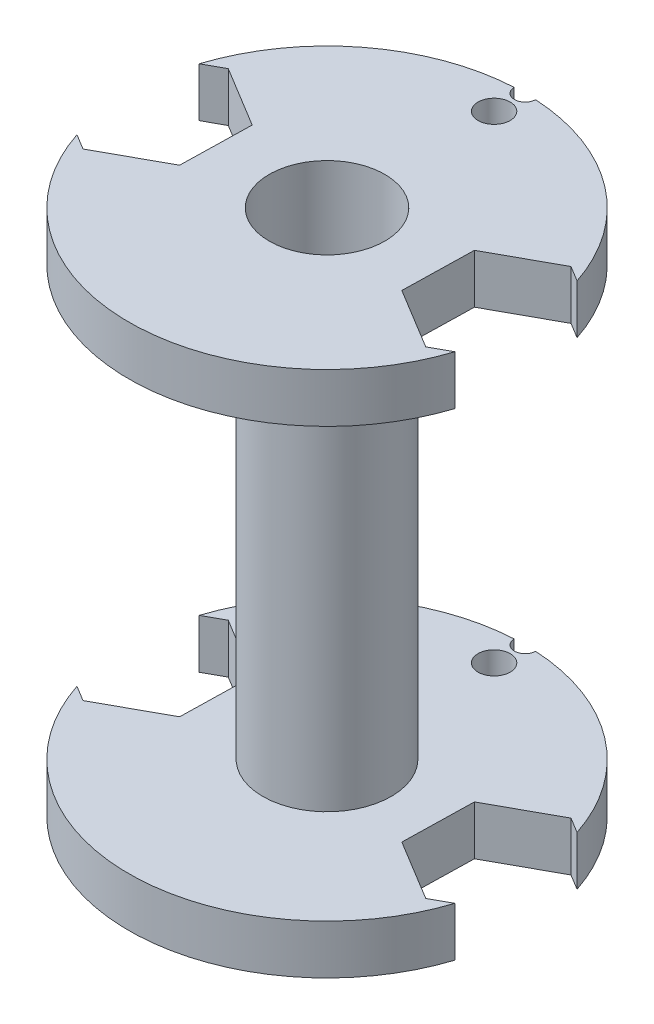
ISO-10303-21;
HEADER;
FILE_DESCRIPTION(('STEP AP214'),'2;1');
FILE_NAME('part.step','',(''),(''),'','','');
FILE_SCHEMA(('AUTOMOTIVE_DESIGN { 1 0 10303 214 1 1 1 1 }'));
ENDSEC;
DATA;
#1=APPLICATION_CONTEXT('core data for automotive mechanical design processes');
#2=APPLICATION_PROTOCOL_DEFINITION('international standard','automotive_design',2000,#1);
#3=PRODUCT_CONTEXT('',#1,'mechanical');
#4=PRODUCT('Part','Part','',(#3));
#5=PRODUCT_RELATED_PRODUCT_CATEGORY('part','',(#4));
#6=PRODUCT_DEFINITION_FORMATION('','',#4);
#7=PRODUCT_DEFINITION_CONTEXT('part definition',#1,'design');
#8=PRODUCT_DEFINITION('design','',#6,#7);
#9=PRODUCT_DEFINITION_SHAPE('','',#8);
#10=(LENGTH_UNIT() NAMED_UNIT(*) SI_UNIT(.MILLI.,.METRE.));
#11=(NAMED_UNIT(*) PLANE_ANGLE_UNIT() SI_UNIT($,.RADIAN.));
#12=(NAMED_UNIT(*) SI_UNIT($,.STERADIAN.) SOLID_ANGLE_UNIT());
#13=UNCERTAINTY_MEASURE_WITH_UNIT(LENGTH_MEASURE(1.E-05),#10,'distance_accuracy_value','');
#14=(GEOMETRIC_REPRESENTATION_CONTEXT(3) GLOBAL_UNCERTAINTY_ASSIGNED_CONTEXT((#13)) GLOBAL_UNIT_ASSIGNED_CONTEXT((#10,
#11,#12)) REPRESENTATION_CONTEXT('',''));
#15=CARTESIAN_POINT('',(0.,0.,0.));
#16=DIRECTION('',(0.,0.,1.));
#17=DIRECTION('',(1.,0.,0.));
#18=AXIS2_PLACEMENT_3D('',#15,#16,#17);
#19=CARTESIAN_POINT('',(0.,2.3,0.));
#20=DIRECTION('',(0.,1.,0.));
#21=DIRECTION('',(0.,0.,1.));
#22=AXIS2_PLACEMENT_3D('',#19,#20,#21);
#23=PLANE('',#22);
#24=CARTESIAN_POINT('',(0.,2.3,-9.25));
#25=DIRECTION('',(0.,1.,0.));
#26=DIRECTION('',(0.,0.,1.));
#27=AXIS2_PLACEMENT_3D('',#24,#25,#26);
#28=CIRCLE('',#27,0.5);
#29=CARTESIAN_POINT('',(-0.499817351592079,2.3,-9.23648648648649));
#30=VERTEX_POINT('',#29);
#31=CARTESIAN_POINT('',(0.499817351592079,2.3,-9.23648648648649));
#32=VERTEX_POINT('',#31);
#33=EDGE_CURVE('E357',#30,#32,#28,.T.);
#34=ORIENTED_EDGE('',*,*,#33,.F.);
#35=CARTESIAN_POINT('',(0.,2.3,0.));
#36=DIRECTION('',(0.,1.,0.));
#37=DIRECTION('',(0.,0.,1.));
#38=AXIS2_PLACEMENT_3D('',#35,#36,#37);
#39=CIRCLE('',#38,9.25);
#40=CARTESIAN_POINT('',(-8.80369400600624,2.3,-2.83856862672189));
#41=VERTEX_POINT('',#40);
#42=EDGE_CURVE('E434',#30,#41,#39,.T.);
#43=ORIENTED_EDGE('',*,*,#42,.T.);
#44=DIRECTION('',(-0.87656895196481,0.,0.48127629533493));
#45=VECTOR('',#44,1.);
#46=CARTESIAN_POINT('',(-3.23668432869814,2.3,-5.89511059935624));
#47=LINE('',#46,#45);
#48=CARTESIAN_POINT('',(-7.92866830299493,2.3,-3.31899760806348));
#49=VERTEX_POINT('',#48);
#50=EDGE_CURVE('E408',#49,#41,#47,.T.);
#51=ORIENTED_EDGE('',*,*,#50,.F.);
#52=DIRECTION('',(-0.855081973981716,0.,-0.518492832902762));
#53=VECTOR('',#52,1.);
#54=CARTESIAN_POINT('',(-0.660011647577101,2.3,1.08847032523397));
#55=LINE('',#54,#53);
#56=CARTESIAN_POINT('',(-5.08999790781407,2.3,-1.59772374233));
#57=VERTEX_POINT('',#56);
#58=EDGE_CURVE('E417',#57,#49,#55,.T.);
#59=ORIENTED_EDGE('',*,*,#58,.F.);
#60=DIRECTION('',(0.0214869779830933,0.,-0.999769128237692));
#61=VECTOR('',#60,1.);
#62=CARTESIAN_POINT('',(-5.1219702345338,2.3,-0.110081076271562));
#63=LINE('',#62,#61);
#64=CARTESIAN_POINT('',(-5.16132960481908,2.3,1.72127386573417));
#65=VERTEX_POINT('',#64);
#66=EDGE_CURVE('E419',#65,#57,#63,.T.);
#67=ORIENTED_EDGE('',*,*,#66,.F.);
#68=DIRECTION('',(0.87656895196481,0.,-0.48127629533493));
#69=VECTOR('',#68,1.);
#70=CARTESIAN_POINT('',(-0.469345630522289,2.3,-0.854839125558582));
#71=LINE('',#70,#69);
#72=CARTESIAN_POINT('',(-8.07133169700495,2.3,3.31899760806487));
#73=VERTEX_POINT('',#72);
#74=EDGE_CURVE('E415',#73,#65,#71,.T.);
#75=ORIENTED_EDGE('',*,*,#74,.F.);
#76=DIRECTION('',(0.855081973981716,0.,0.518492832902762));
#77=VECTOR('',#76,1.);
#78=CARTESIAN_POINT('',(-3.64134543676798,2.3,6.00519167562884));
#79=LINE('',#78,#77);
#80=CARTESIAN_POINT('',(-8.78896564841738,2.3,2.88384861442816));
#81=VERTEX_POINT('',#80);
#82=EDGE_CURVE('E381',#81,#73,#79,.T.);
#83=ORIENTED_EDGE('',*,*,#82,.F.);
#84=CARTESIAN_POINT('',(8.80369400600608,2.3,2.83856862672237));
#85=VERTEX_POINT('',#84);
#86=EDGE_CURVE('E431',#81,#85,#39,.T.);
#87=ORIENTED_EDGE('',*,*,#86,.T.);
#88=DIRECTION('',(0.876568951964868,0.,-0.481276295334824));
#89=VECTOR('',#88,1.);
#90=CARTESIAN_POINT('',(3.23668432869722,2.3,5.89511059935626));
#91=LINE('',#90,#89);
#92=CARTESIAN_POINT('',(7.92866830299465,2.3,3.3189976080639));
#93=VERTEX_POINT('',#92);
#94=EDGE_CURVE('E413',#93,#85,#91,.T.);
#95=ORIENTED_EDGE('',*,*,#94,.F.);
#96=DIRECTION('',(0.855081973981654,0.,0.518492832902865));
#97=VECTOR('',#96,1.);
#98=CARTESIAN_POINT('',(0.660011647577505,2.3,-1.08847032523434));
#99=LINE('',#98,#97);
#100=CARTESIAN_POINT('',(5.089997907814,2.3,1.59772374233007));
#101=VERTEX_POINT('',#100);
#102=EDGE_CURVE('E423',#101,#93,#99,.T.);
#103=ORIENTED_EDGE('',*,*,#102,.F.);
#104=DIRECTION('',(-0.0214869779832137,0.,0.999769128237689));
#105=VECTOR('',#104,1.);
#106=CARTESIAN_POINT('',(5.12197023453389,2.3,0.110081076272182));
#107=LINE('',#106,#105);
#108=CARTESIAN_POINT('',(5.16132960481941,2.3,-1.72127386573409));
#109=VERTEX_POINT('',#108);
#110=EDGE_CURVE('E425',#109,#101,#107,.T.);
#111=ORIENTED_EDGE('',*,*,#110,.F.);
#112=DIRECTION('',(-0.876568951964868,0.,0.481276295334825));
#113=VECTOR('',#112,1.);
#114=CARTESIAN_POINT('',(0.469345630521984,2.3,0.854839125558272));
#115=LINE('',#114,#113);
#116=CARTESIAN_POINT('',(8.07133169700547,2.3,-3.31899760806444));
#117=VERTEX_POINT('',#116);
#118=EDGE_CURVE('E421',#117,#109,#115,.T.);
#119=ORIENTED_EDGE('',*,*,#118,.F.);
#120=DIRECTION('',(-0.855081973981654,0.,-0.518492832902865));
#121=VECTOR('',#120,1.);
#122=CARTESIAN_POINT('',(3.64134543676898,2.3,-6.00519167562885));
#123=LINE('',#122,#121);
#124=CARTESIAN_POINT('',(8.78896564841748,2.3,-2.88384861442786));
#125=VERTEX_POINT('',#124);
#126=EDGE_CURVE('E411',#125,#117,#123,.T.);
#127=ORIENTED_EDGE('',*,*,#126,.F.);
#128=EDGE_CURVE('E436',#125,#32,#39,.T.);
#129=ORIENTED_EDGE('',*,*,#128,.T.);
#130=EDGE_LOOP('',(#34,#43,#51,#59,#67,#75,#83,#87,#95,#103,#111,#119,#127,#129));
#131=FACE_BOUND('',#130,.T.);
#132=CARTESIAN_POINT('',(0.,2.3,-7.8));
#133=DIRECTION('',(0.,1.,0.));
#134=DIRECTION('',(0.,0.,1.));
#135=AXIS2_PLACEMENT_3D('',#132,#133,#134);
#136=CIRCLE('',#135,0.75);
#137=CARTESIAN_POINT('',(0.,2.3,-7.05));
#138=VERTEX_POINT('',#137);
#139=EDGE_CURVE('E358',#138,#138,#136,.T.);
#140=ORIENTED_EDGE('',*,*,#139,.F.);
#141=EDGE_LOOP('',(#140));
#142=FACE_BOUND('',#141,.T.);
#143=CARTESIAN_POINT('',(0.,2.3,0.));
#144=DIRECTION('',(0.,1.,0.));
#145=DIRECTION('',(0.,0.,1.));
#146=AXIS2_PLACEMENT_3D('',#143,#144,#145);
#147=CIRCLE('',#146,3.);
#148=CARTESIAN_POINT('',(0.,2.3,3.));
#149=VERTEX_POINT('',#148);
#150=EDGE_CURVE('E234',#149,#149,#147,.T.);
#151=ORIENTED_EDGE('',*,*,#150,.F.);
#152=EDGE_LOOP('',(#151));
#153=FACE_BOUND('',#152,.T.);
#154=ADVANCED_FACE('F38',(#131,#142,#153),#23,.T.);
#155=CARTESIAN_POINT('',(0.,2.3,0.));
#156=DIRECTION('',(0.,-1.,0.));
#157=DIRECTION('',(0.,0.,-1.));
#158=AXIS2_PLACEMENT_3D('',#155,#156,#157);
#159=CYLINDRICAL_SURFACE('',#158,9.25);
#160=CARTESIAN_POINT('',(0.,0.,0.));
#161=DIRECTION('',(0.,1.,0.));
#162=DIRECTION('',(0.,0.,1.));
#163=AXIS2_PLACEMENT_3D('',#160,#161,#162);
#164=CIRCLE('',#163,9.25);
#165=CARTESIAN_POINT('',(8.78896564841748,0.,-2.88384861442786));
#166=VERTEX_POINT('',#165);
#167=CARTESIAN_POINT('',(0.499817351592092,0.,-9.23648648648649));
#168=VERTEX_POINT('',#167);
#169=EDGE_CURVE('E435',#166,#168,#164,.T.);
#170=ORIENTED_EDGE('',*,*,#169,.T.);
#171=DIRECTION('',(0.,1.,0.));
#172=VECTOR('',#171,1.);
#173=CARTESIAN_POINT('',(0.499817351592079,-0.2,-9.23648648648649));
#174=LINE('',#173,#172);
#175=EDGE_CURVE('E12',#168,#32,#174,.T.);
#176=ORIENTED_EDGE('',*,*,#175,.T.);
#177=ORIENTED_EDGE('',*,*,#128,.F.);
#178=DIRECTION('',(0.,-1.,0.));
#179=VECTOR('',#178,1.);
#180=CARTESIAN_POINT('',(8.78896564841748,2.3,-2.88384861442786));
#181=LINE('',#180,#179);
#182=EDGE_CURVE('E445',#125,#166,#181,.T.);
#183=ORIENTED_EDGE('',*,*,#182,.T.);
#184=EDGE_LOOP('',(#170,#176,#177,#183));
#185=FACE_BOUND('',#184,.T.);
#186=ADVANCED_FACE('F464',(#185),#159,.T.);
#187=CARTESIAN_POINT('',(-8.78896564841738,0.,2.88384861442816));
#188=VERTEX_POINT('',#187);
#189=CARTESIAN_POINT('',(8.80369400600608,0.,2.83856862672237));
#190=VERTEX_POINT('',#189);
#191=EDGE_CURVE('E430',#188,#190,#164,.T.);
#192=ORIENTED_EDGE('',*,*,#191,.T.);
#193=DIRECTION('',(0.,-1.,0.));
#194=VECTOR('',#193,1.);
#195=CARTESIAN_POINT('',(8.80369400600608,2.3,2.83856862672237));
#196=LINE('',#195,#194);
#197=EDGE_CURVE('E448',#190,#85,#196,.F.);
#198=ORIENTED_EDGE('',*,*,#197,.T.);
#199=ORIENTED_EDGE('',*,*,#86,.F.);
#200=DIRECTION('',(0.,-1.,0.));
#201=VECTOR('',#200,1.);
#202=CARTESIAN_POINT('',(-8.78896564841738,2.3,2.88384861442816));
#203=LINE('',#202,#201);
#204=EDGE_CURVE('E440',#81,#188,#203,.T.);
#205=ORIENTED_EDGE('',*,*,#204,.T.);
#206=EDGE_LOOP('',(#192,#198,#199,#205));
#207=FACE_BOUND('',#206,.T.);
#208=ADVANCED_FACE('F494',(#207),#159,.T.);
#209=CARTESIAN_POINT('',(0.,0.,0.));
#210=DIRECTION('',(0.,1.,0.));
#211=DIRECTION('',(0.,0.,1.));
#212=AXIS2_PLACEMENT_3D('',#209,#210,#211);
#213=PLANE('',#212);
#214=CARTESIAN_POINT('',(0.,0.,-7.8));
#215=DIRECTION('',(0.,1.,0.));
#216=DIRECTION('',(0.,0.,1.));
#217=AXIS2_PLACEMENT_3D('',#214,#215,#216);
#218=CIRCLE('',#217,0.75);
#219=CARTESIAN_POINT('',(0.,0.,-7.05));
#220=VERTEX_POINT('',#219);
#221=EDGE_CURVE('E42',#220,#220,#218,.T.);
#222=ORIENTED_EDGE('',*,*,#221,.T.);
#223=EDGE_LOOP('',(#222));
#224=FACE_BOUND('',#223,.T.);
#225=CARTESIAN_POINT('',(-0.499817351592083,0.,-9.23648648648649));
#226=VERTEX_POINT('',#225);
#227=CARTESIAN_POINT('',(-8.80369400600624,0.,-2.83856862672189));
#228=VERTEX_POINT('',#227);
#229=EDGE_CURVE('E439',#226,#228,#164,.T.);
#230=ORIENTED_EDGE('',*,*,#229,.F.);
#231=CARTESIAN_POINT('',(0.,0.,-9.25));
#232=DIRECTION('',(0.,1.,0.));
#233=DIRECTION('',(0.,0.,1.));
#234=AXIS2_PLACEMENT_3D('',#231,#232,#233);
#235=CIRCLE('',#234,0.5);
#236=EDGE_CURVE('E54',#226,#168,#235,.T.);
#237=ORIENTED_EDGE('',*,*,#236,.T.);
#238=ORIENTED_EDGE('',*,*,#169,.F.);
#239=DIRECTION('',(0.855081973981654,0.,0.518492832902865));
#240=VECTOR('',#239,1.);
#241=CARTESIAN_POINT('',(8.07133169700547,0.,-3.31899760806444));
#242=LINE('',#241,#240);
#243=CARTESIAN_POINT('',(8.07133169700547,0.,-3.31899760806444));
#244=VERTEX_POINT('',#243);
#245=EDGE_CURVE('E370',#244,#166,#242,.T.);
#246=ORIENTED_EDGE('',*,*,#245,.F.);
#247=DIRECTION('',(0.876568951964868,0.,-0.481276295334824));
#248=VECTOR('',#247,1.);
#249=CARTESIAN_POINT('',(5.16132960481941,0.,-1.72127386573409));
#250=LINE('',#249,#248);
#251=CARTESIAN_POINT('',(5.16132960481941,0.,-1.72127386573409));
#252=VERTEX_POINT('',#251);
#253=EDGE_CURVE('E366',#252,#244,#250,.T.);
#254=ORIENTED_EDGE('',*,*,#253,.F.);
#255=DIRECTION('',(0.0214869779832137,0.,-0.999769128237689));
#256=VECTOR('',#255,1.);
#257=CARTESIAN_POINT('',(5.089997907814,0.,1.59772374233007));
#258=LINE('',#257,#256);
#259=CARTESIAN_POINT('',(5.089997907814,0.,1.59772374233007));
#260=VERTEX_POINT('',#259);
#261=EDGE_CURVE('E363',#260,#252,#258,.T.);
#262=ORIENTED_EDGE('',*,*,#261,.F.);
#263=DIRECTION('',(-0.855081973981654,0.,-0.518492832902865));
#264=VECTOR('',#263,1.);
#265=CARTESIAN_POINT('',(7.92866830299465,0.,3.3189976080639));
#266=LINE('',#265,#264);
#267=CARTESIAN_POINT('',(7.92866830299465,0.,3.3189976080639));
#268=VERTEX_POINT('',#267);
#269=EDGE_CURVE('E375',#268,#260,#266,.T.);
#270=ORIENTED_EDGE('',*,*,#269,.F.);
#271=DIRECTION('',(-0.876568951964868,0.,0.481276295334824));
#272=VECTOR('',#271,1.);
#273=CARTESIAN_POINT('',(10.8386703951807,0.,1.72127386573356));
#274=LINE('',#273,#272);
#275=EDGE_CURVE('E372',#190,#268,#274,.T.);
#276=ORIENTED_EDGE('',*,*,#275,.F.);
#277=ORIENTED_EDGE('',*,*,#191,.F.);
#278=DIRECTION('',(-0.855081973981716,0.,-0.518492832902762));
#279=VECTOR('',#278,1.);
#280=CARTESIAN_POINT('',(-8.07133169700495,0.,3.31899760806487));
#281=LINE('',#280,#279);
#282=CARTESIAN_POINT('',(-8.07133169700495,0.,3.31899760806487));
#283=VERTEX_POINT('',#282);
#284=EDGE_CURVE('E62',#283,#188,#281,.T.);
#285=ORIENTED_EDGE('',*,*,#284,.F.);
#286=DIRECTION('',(-0.87656895196481,0.,0.48127629533493));
#287=VECTOR('',#286,1.);
#288=CARTESIAN_POINT('',(-5.16132960481908,0.,1.72127386573417));
#289=LINE('',#288,#287);
#290=CARTESIAN_POINT('',(-5.16132960481908,0.,1.72127386573417));
#291=VERTEX_POINT('',#290);
#292=EDGE_CURVE('E390',#291,#283,#289,.T.);
#293=ORIENTED_EDGE('',*,*,#292,.F.);
#294=DIRECTION('',(-0.0214869779830933,0.,0.999769128237692));
#295=VECTOR('',#294,1.);
#296=CARTESIAN_POINT('',(-5.08999790781407,0.,-1.59772374233));
#297=LINE('',#296,#295);
#298=CARTESIAN_POINT('',(-5.08999790781407,0.,-1.59772374233));
#299=VERTEX_POINT('',#298);
#300=EDGE_CURVE('E387',#299,#291,#297,.T.);
#301=ORIENTED_EDGE('',*,*,#300,.F.);
#302=DIRECTION('',(0.855081973981716,0.,0.518492832902762));
#303=VECTOR('',#302,1.);
#304=CARTESIAN_POINT('',(-7.92866830299493,0.,-3.31899760806348));
#305=LINE('',#304,#303);
#306=CARTESIAN_POINT('',(-7.92866830299493,0.,-3.31899760806348));
#307=VERTEX_POINT('',#306);
#308=EDGE_CURVE('E397',#307,#299,#305,.T.);
#309=ORIENTED_EDGE('',*,*,#308,.F.);
#310=DIRECTION('',(0.87656895196481,0.,-0.48127629533493));
#311=VECTOR('',#310,1.);
#312=CARTESIAN_POINT('',(-10.8386703951808,0.,-1.72127386573279));
#313=LINE('',#312,#311);
#314=EDGE_CURVE('E394',#228,#307,#313,.T.);
#315=ORIENTED_EDGE('',*,*,#314,.F.);
#316=EDGE_LOOP('',(#230,#237,#238,#246,#254,#262,#270,#276,#277,#285,#293,#301,#309,#315));
#317=FACE_BOUND('',#316,.T.);
#318=CARTESIAN_POINT('',(0.,0.,0.));
#319=DIRECTION('',(0.,1.,0.));
#320=DIRECTION('',(0.,0.,1.));
#321=AXIS2_PLACEMENT_3D('',#318,#319,#320);
#322=CIRCLE('',#321,2.7);
#323=CARTESIAN_POINT('',(0.,0.,2.7));
#324=VERTEX_POINT('',#323);
#325=EDGE_CURVE('E427',#324,#324,#322,.T.);
#326=ORIENTED_EDGE('',*,*,#325,.T.);
#327=EDGE_LOOP('',(#326));
#328=FACE_BOUND('',#327,.T.);
#329=ADVANCED_FACE('F458',(#224,#317,#328),#213,.F.);
#330=ORIENTED_EDGE('',*,*,#42,.F.);
#331=DIRECTION('',(0.,1.,0.));
#332=VECTOR('',#331,1.);
#333=CARTESIAN_POINT('',(-0.499817351592079,-0.2,-9.23648648648649));
#334=LINE('',#333,#332);
#335=EDGE_CURVE('E47',#30,#226,#334,.F.);
#336=ORIENTED_EDGE('',*,*,#335,.T.);
#337=ORIENTED_EDGE('',*,*,#229,.T.);
#338=DIRECTION('',(0.,-1.,0.));
#339=VECTOR('',#338,1.);
#340=CARTESIAN_POINT('',(-8.80369400600624,2.3,-2.83856862672189));
#341=LINE('',#340,#339);
#342=EDGE_CURVE('E442',#228,#41,#341,.F.);
#343=ORIENTED_EDGE('',*,*,#342,.T.);
#344=EDGE_LOOP('',(#330,#336,#337,#343));
#345=FACE_BOUND('',#344,.T.);
#346=ADVANCED_FACE('F40',(#345),#159,.T.);
#347=CARTESIAN_POINT('',(0.,2.3,0.));
#348=DIRECTION('',(0.,-1.,0.));
#349=DIRECTION('',(0.,0.,-1.));
#350=AXIS2_PLACEMENT_3D('',#347,#348,#349);
#351=CYLINDRICAL_SURFACE('',#350,2.7);
#352=ORIENTED_EDGE('',*,*,#325,.F.);
#353=EDGE_LOOP('',(#352));
#354=FACE_BOUND('',#353,.T.);
#355=CARTESIAN_POINT('',(0.,24.6,0.));
#356=DIRECTION('',(0.,1.,0.));
#357=DIRECTION('',(0.,0.,1.));
#358=AXIS2_PLACEMENT_3D('',#355,#356,#357);
#359=CIRCLE('',#358,2.7);
#360=CARTESIAN_POINT('',(0.,24.6,2.7));
#361=VERTEX_POINT('',#360);
#362=EDGE_CURVE('E336',#361,#361,#359,.T.);
#363=ORIENTED_EDGE('',*,*,#362,.T.);
#364=EDGE_LOOP('',(#363));
#365=FACE_BOUND('',#364,.T.);
#366=ADVANCED_FACE('F536',(#354,#365),#351,.F.);
#367=CARTESIAN_POINT('',(-5.08999790781407,2.5,-1.59772374233));
#368=DIRECTION('',(0.999769128237692,0.,0.0214869779830933));
#369=DIRECTION('',(0.0214869779830933,0.,-0.999769128237692));
#370=AXIS2_PLACEMENT_3D('',#367,#368,#369);
#371=PLANE('',#370);
#372=ORIENTED_EDGE('',*,*,#66,.T.);
#373=DIRECTION('',(0.,-1.,0.));
#374=VECTOR('',#373,1.);
#375=CARTESIAN_POINT('',(-5.08999790781407,2.5,-1.59772374233));
#376=LINE('',#375,#374);
#377=EDGE_CURVE('E367',#57,#299,#376,.T.);
#378=ORIENTED_EDGE('',*,*,#377,.T.);
#379=ORIENTED_EDGE('',*,*,#300,.T.);
#380=DIRECTION('',(0.,-1.,0.));
#381=VECTOR('',#380,1.);
#382=CARTESIAN_POINT('',(-5.16132960481908,2.5,1.72127386573417));
#383=LINE('',#382,#381);
#384=EDGE_CURVE('E400',#65,#291,#383,.T.);
#385=ORIENTED_EDGE('',*,*,#384,.F.);
#386=EDGE_LOOP('',(#372,#378,#379,#385));
#387=FACE_BOUND('',#386,.T.);
#388=ADVANCED_FACE('F508',(#387),#371,.F.);
#389=CARTESIAN_POINT('',(-7.92866830299493,2.5,-3.31899760806348));
#390=DIRECTION('',(0.518492832902762,0.,-0.855081973981716));
#391=DIRECTION('',(-0.855081973981716,0.,-0.518492832902762));
#392=AXIS2_PLACEMENT_3D('',#389,#390,#391);
#393=PLANE('',#392);
#394=ORIENTED_EDGE('',*,*,#58,.T.);
#395=DIRECTION('',(0.,-1.,0.));
#396=VECTOR('',#395,1.);
#397=CARTESIAN_POINT('',(-7.92866830299493,2.5,-3.31899760806348));
#398=LINE('',#397,#396);
#399=EDGE_CURVE('E402',#49,#307,#398,.T.);
#400=ORIENTED_EDGE('',*,*,#399,.T.);
#401=ORIENTED_EDGE('',*,*,#308,.T.);
#402=ORIENTED_EDGE('',*,*,#377,.F.);
#403=EDGE_LOOP('',(#394,#400,#401,#402));
#404=FACE_BOUND('',#403,.T.);
#405=ADVANCED_FACE('F512',(#404),#393,.F.);
#406=CARTESIAN_POINT('',(-10.8386703951808,2.5,-1.72127386573279));
#407=DIRECTION('',(-0.48127629533493,0.,-0.87656895196481));
#408=DIRECTION('',(-0.87656895196481,0.,0.48127629533493));
#409=AXIS2_PLACEMENT_3D('',#406,#407,#408);
#410=PLANE('',#409);
#411=ORIENTED_EDGE('',*,*,#50,.T.);
#412=ORIENTED_EDGE('',*,*,#342,.F.);
#413=ORIENTED_EDGE('',*,*,#314,.T.);
#414=ORIENTED_EDGE('',*,*,#399,.F.);
#415=EDGE_LOOP('',(#411,#412,#413,#414));
#416=FACE_BOUND('',#415,.T.);
#417=ADVANCED_FACE('F516',(#416),#410,.F.);
#418=CARTESIAN_POINT('',(-8.07133169700495,2.5,3.31899760806487));
#419=DIRECTION('',(-0.518492832902762,0.,0.855081973981716));
#420=DIRECTION('',(0.855081973981716,0.,0.518492832902762));
#421=AXIS2_PLACEMENT_3D('',#418,#419,#420);
#422=PLANE('',#421);
#423=ORIENTED_EDGE('',*,*,#82,.T.);
#424=DIRECTION('',(0.,-1.,0.));
#425=VECTOR('',#424,1.);
#426=CARTESIAN_POINT('',(-8.07133169700495,2.5,3.31899760806487));
#427=LINE('',#426,#425);
#428=EDGE_CURVE('E404',#73,#283,#427,.T.);
#429=ORIENTED_EDGE('',*,*,#428,.T.);
#430=ORIENTED_EDGE('',*,*,#284,.T.);
#431=ORIENTED_EDGE('',*,*,#204,.F.);
#432=EDGE_LOOP('',(#423,#429,#430,#431));
#433=FACE_BOUND('',#432,.T.);
#434=ADVANCED_FACE('F501',(#433),#422,.F.);
#435=CARTESIAN_POINT('',(-5.16132960481908,2.5,1.72127386573417));
#436=DIRECTION('',(0.48127629533493,0.,0.87656895196481));
#437=DIRECTION('',(0.87656895196481,0.,-0.48127629533493));
#438=AXIS2_PLACEMENT_3D('',#435,#436,#437);
#439=PLANE('',#438);
#440=ORIENTED_EDGE('',*,*,#74,.T.);
#441=ORIENTED_EDGE('',*,*,#384,.T.);
#442=ORIENTED_EDGE('',*,*,#292,.T.);
#443=ORIENTED_EDGE('',*,*,#428,.F.);
#444=EDGE_LOOP('',(#440,#441,#442,#443));
#445=FACE_BOUND('',#444,.T.);
#446=ADVANCED_FACE('F503',(#445),#439,.F.);
#447=CARTESIAN_POINT('',(5.089997907814,2.5,1.59772374233007));
#448=DIRECTION('',(-0.999769128237689,0.,-0.0214869779832137));
#449=DIRECTION('',(-0.0214869779832137,0.,0.999769128237689));
#450=AXIS2_PLACEMENT_3D('',#447,#448,#449);
#451=PLANE('',#450);
#452=ORIENTED_EDGE('',*,*,#110,.T.);
#453=DIRECTION('',(0.,-1.,0.));
#454=VECTOR('',#453,1.);
#455=CARTESIAN_POINT('',(5.089997907814,2.5,1.59772374233007));
#456=LINE('',#455,#454);
#457=EDGE_CURVE('E379',#101,#260,#456,.T.);
#458=ORIENTED_EDGE('',*,*,#457,.T.);
#459=ORIENTED_EDGE('',*,*,#261,.T.);
#460=DIRECTION('',(0.,-1.,0.));
#461=VECTOR('',#460,1.);
#462=CARTESIAN_POINT('',(5.16132960481941,2.5,-1.72127386573409));
#463=LINE('',#462,#461);
#464=EDGE_CURVE('E378',#109,#252,#463,.T.);
#465=ORIENTED_EDGE('',*,*,#464,.F.);
#466=EDGE_LOOP('',(#452,#458,#459,#465));
#467=FACE_BOUND('',#466,.T.);
#468=ADVANCED_FACE('F480',(#467),#451,.F.);
#469=CARTESIAN_POINT('',(7.92866830299465,2.5,3.3189976080639));
#470=DIRECTION('',(-0.518492832902865,0.,0.855081973981654));
#471=DIRECTION('',(0.855081973981654,0.,0.518492832902865));
#472=AXIS2_PLACEMENT_3D('',#469,#470,#471);
#473=PLANE('',#472);
#474=ORIENTED_EDGE('',*,*,#102,.T.);
#475=DIRECTION('',(0.,-1.,0.));
#476=VECTOR('',#475,1.);
#477=CARTESIAN_POINT('',(7.92866830299465,2.5,3.3189976080639));
#478=LINE('',#477,#476);
#479=EDGE_CURVE('E382',#93,#268,#478,.T.);
#480=ORIENTED_EDGE('',*,*,#479,.T.);
#481=ORIENTED_EDGE('',*,*,#269,.T.);
#482=ORIENTED_EDGE('',*,*,#457,.F.);
#483=EDGE_LOOP('',(#474,#480,#481,#482));
#484=FACE_BOUND('',#483,.T.);
#485=ADVANCED_FACE('F486',(#484),#473,.F.);
#486=CARTESIAN_POINT('',(10.8386703951807,2.5,1.72127386573356));
#487=DIRECTION('',(0.481276295334824,0.,0.876568951964868));
#488=DIRECTION('',(0.876568951964868,0.,-0.481276295334824));
#489=AXIS2_PLACEMENT_3D('',#486,#487,#488);
#490=PLANE('',#489);
#491=ORIENTED_EDGE('',*,*,#94,.T.);
#492=ORIENTED_EDGE('',*,*,#197,.F.);
#493=ORIENTED_EDGE('',*,*,#275,.T.);
#494=ORIENTED_EDGE('',*,*,#479,.F.);
#495=EDGE_LOOP('',(#491,#492,#493,#494));
#496=FACE_BOUND('',#495,.T.);
#497=ADVANCED_FACE('F491',(#496),#490,.F.);
#498=CARTESIAN_POINT('',(8.07133169700547,2.5,-3.31899760806444));
#499=DIRECTION('',(0.518492832902865,0.,-0.855081973981654));
#500=DIRECTION('',(-0.855081973981654,0.,-0.518492832902865));
#501=AXIS2_PLACEMENT_3D('',#498,#499,#500);
#502=PLANE('',#501);
#503=ORIENTED_EDGE('',*,*,#126,.T.);
#504=DIRECTION('',(0.,-1.,0.));
#505=VECTOR('',#504,1.);
#506=CARTESIAN_POINT('',(8.07133169700547,2.5,-3.31899760806444));
#507=LINE('',#506,#505);
#508=EDGE_CURVE('E384',#117,#244,#507,.T.);
#509=ORIENTED_EDGE('',*,*,#508,.T.);
#510=ORIENTED_EDGE('',*,*,#245,.T.);
#511=ORIENTED_EDGE('',*,*,#182,.F.);
#512=EDGE_LOOP('',(#503,#509,#510,#511));
#513=FACE_BOUND('',#512,.T.);
#514=ADVANCED_FACE('F471',(#513),#502,.F.);
#515=CARTESIAN_POINT('',(5.16132960481941,2.5,-1.72127386573409));
#516=DIRECTION('',(-0.481276295334824,0.,-0.876568951964868));
#517=DIRECTION('',(-0.876568951964868,0.,0.481276295334825));
#518=AXIS2_PLACEMENT_3D('',#515,#516,#517);
#519=PLANE('',#518);
#520=ORIENTED_EDGE('',*,*,#118,.T.);
#521=ORIENTED_EDGE('',*,*,#464,.T.);
#522=ORIENTED_EDGE('',*,*,#253,.T.);
#523=ORIENTED_EDGE('',*,*,#508,.F.);
#524=EDGE_LOOP('',(#520,#521,#522,#523));
#525=FACE_BOUND('',#524,.T.);
#526=ADVANCED_FACE('F476',(#525),#519,.F.);
#527=CARTESIAN_POINT('',(0.,-2.7,-9.25));
#528=DIRECTION('',(0.,1.,0.));
#529=DIRECTION('',(0.,0.,1.));
#530=AXIS2_PLACEMENT_3D('',#527,#528,#529);
#531=CYLINDRICAL_SURFACE('',#530,0.5);
#532=ORIENTED_EDGE('',*,*,#236,.F.);
#533=ORIENTED_EDGE('',*,*,#335,.F.);
#534=ORIENTED_EDGE('',*,*,#33,.T.);
#535=ORIENTED_EDGE('',*,*,#175,.F.);
#536=EDGE_LOOP('',(#532,#533,#534,#535));
#537=FACE_BOUND('',#536,.T.);
#538=ADVANCED_FACE('F517',(#537),#531,.F.);
#539=CARTESIAN_POINT('',(0.,-2.7,-7.8));
#540=DIRECTION('',(0.,1.,0.));
#541=DIRECTION('',(0.,0.,1.));
#542=AXIS2_PLACEMENT_3D('',#539,#540,#541);
#543=CYLINDRICAL_SURFACE('',#542,0.75);
#544=ORIENTED_EDGE('',*,*,#139,.T.);
#545=EDGE_LOOP('',(#544));
#546=FACE_BOUND('',#545,.T.);
#547=ORIENTED_EDGE('',*,*,#221,.F.);
#548=EDGE_LOOP('',(#547));
#549=FACE_BOUND('',#548,.T.);
#550=ADVANCED_FACE('F519',(#546,#549),#543,.F.);
#551=CARTESIAN_POINT('',(0.,12.3,0.));
#552=DIRECTION('',(0.,-1.,0.));
#553=DIRECTION('',(0.,0.,-1.));
#554=AXIS2_PLACEMENT_3D('',#551,#552,#553);
#555=CYLINDRICAL_SURFACE('',#554,3.);
#556=ORIENTED_EDGE('',*,*,#150,.T.);
#557=EDGE_LOOP('',(#556));
#558=FACE_BOUND('',#557,.T.);
#559=CARTESIAN_POINT('',(0.,22.3,0.));
#560=DIRECTION('',(0.,1.,0.));
#561=DIRECTION('',(0.,0.,1.));
#562=AXIS2_PLACEMENT_3D('',#559,#560,#561);
#563=CIRCLE('',#562,3.);
#564=CARTESIAN_POINT('',(0.,22.3,3.));
#565=VERTEX_POINT('',#564);
#566=EDGE_CURVE('E255',#565,#565,#563,.T.);
#567=ORIENTED_EDGE('',*,*,#566,.F.);
#568=EDGE_LOOP('',(#567));
#569=FACE_BOUND('',#568,.T.);
#570=ADVANCED_FACE('F525',(#558,#569),#555,.T.);
#571=CARTESIAN_POINT('',(0.,22.3,0.));
#572=DIRECTION('',(0.,-1.,0.));
#573=DIRECTION('',(0.,0.,1.));
#574=AXIS2_PLACEMENT_3D('',#571,#572,#573);
#575=PLANE('',#574);
#576=CARTESIAN_POINT('',(0.,22.3,-9.25));
#577=DIRECTION('',(0.,1.,0.));
#578=DIRECTION('',(0.,0.,1.));
#579=AXIS2_PLACEMENT_3D('',#576,#577,#578);
#580=CIRCLE('',#579,0.5);
#581=CARTESIAN_POINT('',(-0.499817351592079,22.3,-9.23648648648649));
#582=VERTEX_POINT('',#581);
#583=CARTESIAN_POINT('',(0.499817351592079,22.3,-9.23648648648649));
#584=VERTEX_POINT('',#583);
#585=EDGE_CURVE('E228',#582,#584,#580,.T.);
#586=ORIENTED_EDGE('',*,*,#585,.T.);
#587=CARTESIAN_POINT('',(0.,22.3,0.));
#588=DIRECTION('',(0.,1.,0.));
#589=DIRECTION('',(0.,0.,1.));
#590=AXIS2_PLACEMENT_3D('',#587,#588,#589);
#591=CIRCLE('',#590,9.25);
#592=CARTESIAN_POINT('',(8.78896564841748,22.3,-2.88384861442786));
#593=VERTEX_POINT('',#592);
#594=EDGE_CURVE('E238',#593,#584,#591,.T.);
#595=ORIENTED_EDGE('',*,*,#594,.F.);
#596=DIRECTION('',(-0.855081973981654,0.,-0.518492832902865));
#597=VECTOR('',#596,1.);
#598=CARTESIAN_POINT('',(3.64134543676898,22.3,-6.00519167562885));
#599=LINE('',#598,#597);
#600=CARTESIAN_POINT('',(8.07133169700547,22.3,-3.31899760806444));
#601=VERTEX_POINT('',#600);
#602=EDGE_CURVE('E313',#593,#601,#599,.T.);
#603=ORIENTED_EDGE('',*,*,#602,.T.);
#604=DIRECTION('',(-0.876568951964868,0.,0.481276295334825));
#605=VECTOR('',#604,1.);
#606=CARTESIAN_POINT('',(0.469345630521984,22.3,0.854839125558272));
#607=LINE('',#606,#605);
#608=CARTESIAN_POINT('',(5.16132960481941,22.3,-1.72127386573409));
#609=VERTEX_POINT('',#608);
#610=EDGE_CURVE('E327',#601,#609,#607,.T.);
#611=ORIENTED_EDGE('',*,*,#610,.T.);
#612=DIRECTION('',(-0.0214869779832137,0.,0.999769128237689));
#613=VECTOR('',#612,1.);
#614=CARTESIAN_POINT('',(5.12197023453389,22.3,0.110081076272182));
#615=LINE('',#614,#613);
#616=CARTESIAN_POINT('',(5.089997907814,22.3,1.59772374233007));
#617=VERTEX_POINT('',#616);
#618=EDGE_CURVE('E333',#609,#617,#615,.T.);
#619=ORIENTED_EDGE('',*,*,#618,.T.);
#620=DIRECTION('',(0.855081973981654,0.,0.518492832902865));
#621=VECTOR('',#620,1.);
#622=CARTESIAN_POINT('',(0.660011647577505,22.3,-1.08847032523434));
#623=LINE('',#622,#621);
#624=CARTESIAN_POINT('',(7.92866830299465,22.3,3.3189976080639));
#625=VERTEX_POINT('',#624);
#626=EDGE_CURVE('E330',#617,#625,#623,.T.);
#627=ORIENTED_EDGE('',*,*,#626,.T.);
#628=DIRECTION('',(0.876568951964868,0.,-0.481276295334824));
#629=VECTOR('',#628,1.);
#630=CARTESIAN_POINT('',(3.23668432869722,22.3,5.89511059935626));
#631=LINE('',#630,#629);
#632=CARTESIAN_POINT('',(8.80369400600608,22.3,2.83856862672237));
#633=VERTEX_POINT('',#632);
#634=EDGE_CURVE('E315',#625,#633,#631,.T.);
#635=ORIENTED_EDGE('',*,*,#634,.T.);
#636=CARTESIAN_POINT('',(-8.78896564841738,22.3,2.88384861442816));
#637=VERTEX_POINT('',#636);
#638=EDGE_CURVE('E248',#637,#633,#591,.T.);
#639=ORIENTED_EDGE('',*,*,#638,.F.);
#640=DIRECTION('',(0.855081973981716,0.,0.518492832902762));
#641=VECTOR('',#640,1.);
#642=CARTESIAN_POINT('',(-3.64134543676798,22.3,6.00519167562884));
#643=LINE('',#642,#641);
#644=CARTESIAN_POINT('',(-8.07133169700495,22.3,3.31899760806487));
#645=VERTEX_POINT('',#644);
#646=EDGE_CURVE('E282',#637,#645,#643,.T.);
#647=ORIENTED_EDGE('',*,*,#646,.T.);
#648=DIRECTION('',(0.87656895196481,0.,-0.48127629533493));
#649=VECTOR('',#648,1.);
#650=CARTESIAN_POINT('',(-0.469345630522289,22.3,-0.854839125558582));
#651=LINE('',#650,#649);
#652=CARTESIAN_POINT('',(-5.16132960481908,22.3,1.72127386573417));
#653=VERTEX_POINT('',#652);
#654=EDGE_CURVE('E318',#645,#653,#651,.T.);
#655=ORIENTED_EDGE('',*,*,#654,.T.);
#656=DIRECTION('',(0.0214869779830933,0.,-0.999769128237692));
#657=VECTOR('',#656,1.);
#658=CARTESIAN_POINT('',(-5.1219702345338,22.3,-0.110081076271562));
#659=LINE('',#658,#657);
#660=CARTESIAN_POINT('',(-5.08999790781407,22.3,-1.59772374233));
#661=VERTEX_POINT('',#660);
#662=EDGE_CURVE('E324',#653,#661,#659,.T.);
#663=ORIENTED_EDGE('',*,*,#662,.T.);
#664=DIRECTION('',(-0.855081973981716,0.,-0.518492832902762));
#665=VECTOR('',#664,1.);
#666=CARTESIAN_POINT('',(-0.660011647577101,22.3,1.08847032523397));
#667=LINE('',#666,#665);
#668=CARTESIAN_POINT('',(-7.92866830299493,22.3,-3.31899760806348));
#669=VERTEX_POINT('',#668);
#670=EDGE_CURVE('E321',#661,#669,#667,.T.);
#671=ORIENTED_EDGE('',*,*,#670,.T.);
#672=DIRECTION('',(-0.87656895196481,0.,0.48127629533493));
#673=VECTOR('',#672,1.);
#674=CARTESIAN_POINT('',(-3.23668432869814,22.3,-5.89511059935624));
#675=LINE('',#674,#673);
#676=CARTESIAN_POINT('',(-8.80369400600624,22.3,-2.83856862672189));
#677=VERTEX_POINT('',#676);
#678=EDGE_CURVE('E311',#669,#677,#675,.T.);
#679=ORIENTED_EDGE('',*,*,#678,.T.);
#680=EDGE_CURVE('E246',#582,#677,#591,.T.);
#681=ORIENTED_EDGE('',*,*,#680,.F.);
#682=EDGE_LOOP('',(#586,#595,#603,#611,#619,#627,#635,#639,#647,#655,#663,#671,#679,#681));
#683=FACE_BOUND('',#682,.T.);
#684=CARTESIAN_POINT('',(0.,22.3,-7.8));
#685=DIRECTION('',(0.,1.,0.));
#686=DIRECTION('',(0.,0.,1.));
#687=AXIS2_PLACEMENT_3D('',#684,#685,#686);
#688=CIRCLE('',#687,0.75);
#689=CARTESIAN_POINT('',(0.,22.3,-7.05));
#690=VERTEX_POINT('',#689);
#691=EDGE_CURVE('E254',#690,#690,#688,.T.);
#692=ORIENTED_EDGE('',*,*,#691,.T.);
#693=EDGE_LOOP('',(#692));
#694=FACE_BOUND('',#693,.T.);
#695=ORIENTED_EDGE('',*,*,#566,.T.);
#696=EDGE_LOOP('',(#695));
#697=FACE_BOUND('',#696,.T.);
#698=ADVANCED_FACE('F250',(#683,#694,#697),#575,.T.);
#699=CARTESIAN_POINT('',(0.,22.3,0.));
#700=DIRECTION('',(0.,1.,0.));
#701=DIRECTION('',(0.,0.,-1.));
#702=AXIS2_PLACEMENT_3D('',#699,#700,#701);
#703=CYLINDRICAL_SURFACE('',#702,9.25);
#704=CARTESIAN_POINT('',(0.,24.6,0.));
#705=DIRECTION('',(0.,1.,0.));
#706=DIRECTION('',(0.,0.,1.));
#707=AXIS2_PLACEMENT_3D('',#704,#705,#706);
#708=CIRCLE('',#707,9.25);
#709=CARTESIAN_POINT('',(8.78896564841748,24.6,-2.88384861442786));
#710=VERTEX_POINT('',#709);
#711=CARTESIAN_POINT('',(0.499817351592092,24.6,-9.23648648648649));
#712=VERTEX_POINT('',#711);
#713=EDGE_CURVE('E341',#710,#712,#708,.T.);
#714=ORIENTED_EDGE('',*,*,#713,.F.);
#715=DIRECTION('',(0.,1.,0.));
#716=VECTOR('',#715,1.);
#717=CARTESIAN_POINT('',(8.78896564841748,22.3,-2.88384861442786));
#718=LINE('',#717,#716);
#719=EDGE_CURVE('E241',#593,#710,#718,.T.);
#720=ORIENTED_EDGE('',*,*,#719,.F.);
#721=ORIENTED_EDGE('',*,*,#594,.T.);
#722=DIRECTION('',(0.,-1.,0.));
#723=VECTOR('',#722,1.);
#724=CARTESIAN_POINT('',(0.499817351592079,24.8,-9.23648648648649));
#725=LINE('',#724,#723);
#726=EDGE_CURVE('E224',#712,#584,#725,.T.);
#727=ORIENTED_EDGE('',*,*,#726,.F.);
#728=EDGE_LOOP('',(#714,#720,#721,#727));
#729=FACE_BOUND('',#728,.T.);
#730=ADVANCED_FACE('F239',(#729),#703,.T.);
#731=CARTESIAN_POINT('',(-8.78896564841738,24.6,2.88384861442816));
#732=VERTEX_POINT('',#731);
#733=CARTESIAN_POINT('',(8.80369400600608,24.6,2.83856862672237));
#734=VERTEX_POINT('',#733);
#735=EDGE_CURVE('E338',#732,#734,#708,.T.);
#736=ORIENTED_EDGE('',*,*,#735,.F.);
#737=DIRECTION('',(0.,1.,0.));
#738=VECTOR('',#737,1.);
#739=CARTESIAN_POINT('',(-8.78896564841738,22.3,2.88384861442816));
#740=LINE('',#739,#738);
#741=EDGE_CURVE('E245',#637,#732,#740,.T.);
#742=ORIENTED_EDGE('',*,*,#741,.F.);
#743=ORIENTED_EDGE('',*,*,#638,.T.);
#744=DIRECTION('',(0.,1.,0.));
#745=VECTOR('',#744,1.);
#746=CARTESIAN_POINT('',(8.80369400600608,22.3,2.83856862672237));
#747=LINE('',#746,#745);
#748=EDGE_CURVE('E350',#734,#633,#747,.F.);
#749=ORIENTED_EDGE('',*,*,#748,.F.);
#750=EDGE_LOOP('',(#736,#742,#743,#749));
#751=FACE_BOUND('',#750,.T.);
#752=ADVANCED_FACE('F693',(#751),#703,.T.);
#753=CARTESIAN_POINT('',(0.,24.6,0.));
#754=DIRECTION('',(0.,-1.,0.));
#755=DIRECTION('',(0.,0.,1.));
#756=AXIS2_PLACEMENT_3D('',#753,#754,#755);
#757=PLANE('',#756);
#758=CARTESIAN_POINT('',(0.,24.6,-7.8));
#759=DIRECTION('',(0.,1.,0.));
#760=DIRECTION('',(0.,0.,1.));
#761=AXIS2_PLACEMENT_3D('',#758,#759,#760);
#762=CIRCLE('',#761,0.75);
#763=CARTESIAN_POINT('',(0.,24.6,-7.05));
#764=VERTEX_POINT('',#763);
#765=EDGE_CURVE('E263',#764,#764,#762,.T.);
#766=ORIENTED_EDGE('',*,*,#765,.F.);
#767=EDGE_LOOP('',(#766));
#768=FACE_BOUND('',#767,.T.);
#769=CARTESIAN_POINT('',(-0.499817351592083,24.6,-9.23648648648649));
#770=VERTEX_POINT('',#769);
#771=CARTESIAN_POINT('',(-8.80369400600624,24.6,-2.83856862672189));
#772=VERTEX_POINT('',#771);
#773=EDGE_CURVE('E344',#770,#772,#708,.T.);
#774=ORIENTED_EDGE('',*,*,#773,.T.);
#775=DIRECTION('',(0.87656895196481,0.,-0.48127629533493));
#776=VECTOR('',#775,1.);
#777=CARTESIAN_POINT('',(-10.8386703951808,24.6,-1.72127386573279));
#778=LINE('',#777,#776);
#779=CARTESIAN_POINT('',(-7.92866830299493,24.6,-3.31899760806348));
#780=VERTEX_POINT('',#779);
#781=EDGE_CURVE('E296',#772,#780,#778,.T.);
#782=ORIENTED_EDGE('',*,*,#781,.T.);
#783=DIRECTION('',(0.855081973981716,0.,0.518492832902762));
#784=VECTOR('',#783,1.);
#785=CARTESIAN_POINT('',(-7.92866830299493,24.6,-3.31899760806348));
#786=LINE('',#785,#784);
#787=CARTESIAN_POINT('',(-5.08999790781407,24.6,-1.59772374233));
#788=VERTEX_POINT('',#787);
#789=EDGE_CURVE('E299',#780,#788,#786,.T.);
#790=ORIENTED_EDGE('',*,*,#789,.T.);
#791=DIRECTION('',(-0.0214869779830933,0.,0.999769128237692));
#792=VECTOR('',#791,1.);
#793=CARTESIAN_POINT('',(-5.08999790781407,24.6,-1.59772374233));
#794=LINE('',#793,#792);
#795=CARTESIAN_POINT('',(-5.16132960481908,24.6,1.72127386573417));
#796=VERTEX_POINT('',#795);
#797=EDGE_CURVE('E288',#788,#796,#794,.T.);
#798=ORIENTED_EDGE('',*,*,#797,.T.);
#799=DIRECTION('',(-0.87656895196481,0.,0.48127629533493));
#800=VECTOR('',#799,1.);
#801=CARTESIAN_POINT('',(-5.16132960481908,24.6,1.72127386573417));
#802=LINE('',#801,#800);
#803=CARTESIAN_POINT('',(-8.07133169700495,24.6,3.31899760806487));
#804=VERTEX_POINT('',#803);
#805=EDGE_CURVE('E291',#796,#804,#802,.T.);
#806=ORIENTED_EDGE('',*,*,#805,.T.);
#807=DIRECTION('',(-0.855081973981716,0.,-0.518492832902762));
#808=VECTOR('',#807,1.);
#809=CARTESIAN_POINT('',(-8.07133169700495,24.6,3.31899760806487));
#810=LINE('',#809,#808);
#811=EDGE_CURVE('E294',#804,#732,#810,.T.);
#812=ORIENTED_EDGE('',*,*,#811,.T.);
#813=ORIENTED_EDGE('',*,*,#735,.T.);
#814=DIRECTION('',(-0.876568951964868,0.,0.481276295334824));
#815=VECTOR('',#814,1.);
#816=CARTESIAN_POINT('',(10.8386703951807,24.6,1.72127386573356));
#817=LINE('',#816,#815);
#818=CARTESIAN_POINT('',(7.92866830299465,24.6,3.3189976080639));
#819=VERTEX_POINT('',#818);
#820=EDGE_CURVE('E273',#734,#819,#817,.T.);
#821=ORIENTED_EDGE('',*,*,#820,.T.);
#822=DIRECTION('',(-0.855081973981654,0.,-0.518492832902865));
#823=VECTOR('',#822,1.);
#824=CARTESIAN_POINT('',(7.92866830299465,24.6,3.3189976080639));
#825=LINE('',#824,#823);
#826=CARTESIAN_POINT('',(5.089997907814,24.6,1.59772374233007));
#827=VERTEX_POINT('',#826);
#828=EDGE_CURVE('E276',#819,#827,#825,.T.);
#829=ORIENTED_EDGE('',*,*,#828,.T.);
#830=DIRECTION('',(0.0214869779832137,0.,-0.999769128237689));
#831=VECTOR('',#830,1.);
#832=CARTESIAN_POINT('',(5.089997907814,24.6,1.59772374233007));
#833=LINE('',#832,#831);
#834=CARTESIAN_POINT('',(5.16132960481941,24.6,-1.72127386573409));
#835=VERTEX_POINT('',#834);
#836=EDGE_CURVE('E264',#827,#835,#833,.T.);
#837=ORIENTED_EDGE('',*,*,#836,.T.);
#838=DIRECTION('',(0.876568951964868,0.,-0.481276295334824));
#839=VECTOR('',#838,1.);
#840=CARTESIAN_POINT('',(5.16132960481941,24.6,-1.72127386573409));
#841=LINE('',#840,#839);
#842=CARTESIAN_POINT('',(8.07133169700547,24.6,-3.31899760806444));
#843=VERTEX_POINT('',#842);
#844=EDGE_CURVE('E267',#835,#843,#841,.T.);
#845=ORIENTED_EDGE('',*,*,#844,.T.);
#846=DIRECTION('',(0.855081973981654,0.,0.518492832902865));
#847=VECTOR('',#846,1.);
#848=CARTESIAN_POINT('',(8.07133169700547,24.6,-3.31899760806444));
#849=LINE('',#848,#847);
#850=EDGE_CURVE('E271',#843,#710,#849,.T.);
#851=ORIENTED_EDGE('',*,*,#850,.T.);
#852=ORIENTED_EDGE('',*,*,#713,.T.);
#853=CARTESIAN_POINT('',(0.,24.6,-9.25));
#854=DIRECTION('',(0.,1.,0.));
#855=DIRECTION('',(0.,0.,1.));
#856=AXIS2_PLACEMENT_3D('',#853,#854,#855);
#857=CIRCLE('',#856,0.5);
#858=EDGE_CURVE('E230',#770,#712,#857,.T.);
#859=ORIENTED_EDGE('',*,*,#858,.F.);
#860=EDGE_LOOP('',(#774,#782,#790,#798,#806,#812,#813,#821,#829,#837,#845,#851,#852,#859));
#861=FACE_BOUND('',#860,.T.);
#862=ORIENTED_EDGE('',*,*,#362,.F.);
#863=EDGE_LOOP('',(#862));
#864=FACE_BOUND('',#863,.T.);
#865=ADVANCED_FACE('F702',(#768,#861,#864),#757,.F.);
#866=ORIENTED_EDGE('',*,*,#680,.T.);
#867=DIRECTION('',(0.,1.,0.));
#868=VECTOR('',#867,1.);
#869=CARTESIAN_POINT('',(-8.80369400600624,22.3,-2.83856862672189));
#870=LINE('',#869,#868);
#871=EDGE_CURVE('E347',#772,#677,#870,.F.);
#872=ORIENTED_EDGE('',*,*,#871,.F.);
#873=ORIENTED_EDGE('',*,*,#773,.F.);
#874=DIRECTION('',(0.,-1.,0.));
#875=VECTOR('',#874,1.);
#876=CARTESIAN_POINT('',(-0.499817351592079,24.8,-9.23648648648649));
#877=LINE('',#876,#875);
#878=EDGE_CURVE('E235',#582,#770,#877,.F.);
#879=ORIENTED_EDGE('',*,*,#878,.F.);
#880=EDGE_LOOP('',(#866,#872,#873,#879));
#881=FACE_BOUND('',#880,.T.);
#882=ADVANCED_FACE('F695',(#881),#703,.T.);
#883=CARTESIAN_POINT('',(-5.08999790781407,22.1,-1.59772374233));
#884=DIRECTION('',(0.999769128237692,0.,0.0214869779830933));
#885=DIRECTION('',(0.0214869779830933,0.,-0.999769128237692));
#886=AXIS2_PLACEMENT_3D('',#883,#884,#885);
#887=PLANE('',#886);
#888=ORIENTED_EDGE('',*,*,#662,.F.);
#889=DIRECTION('',(0.,1.,0.));
#890=VECTOR('',#889,1.);
#891=CARTESIAN_POINT('',(-5.16132960481908,22.1,1.72127386573417));
#892=LINE('',#891,#890);
#893=EDGE_CURVE('E302',#653,#796,#892,.T.);
#894=ORIENTED_EDGE('',*,*,#893,.T.);
#895=ORIENTED_EDGE('',*,*,#797,.F.);
#896=DIRECTION('',(0.,1.,0.));
#897=VECTOR('',#896,1.);
#898=CARTESIAN_POINT('',(-5.08999790781407,22.1,-1.59772374233));
#899=LINE('',#898,#897);
#900=EDGE_CURVE('E268',#661,#788,#899,.T.);
#901=ORIENTED_EDGE('',*,*,#900,.F.);
#902=EDGE_LOOP('',(#888,#894,#895,#901));
#903=FACE_BOUND('',#902,.T.);
#904=ADVANCED_FACE('F718',(#903),#887,.F.);
#905=CARTESIAN_POINT('',(-7.92866830299493,22.1,-3.31899760806348));
#906=DIRECTION('',(0.518492832902762,0.,-0.855081973981716));
#907=DIRECTION('',(-0.855081973981716,0.,-0.518492832902762));
#908=AXIS2_PLACEMENT_3D('',#905,#906,#907);
#909=PLANE('',#908);
#910=ORIENTED_EDGE('',*,*,#670,.F.);
#911=ORIENTED_EDGE('',*,*,#900,.T.);
#912=ORIENTED_EDGE('',*,*,#789,.F.);
#913=DIRECTION('',(0.,1.,0.));
#914=VECTOR('',#913,1.);
#915=CARTESIAN_POINT('',(-7.92866830299493,22.1,-3.31899760806348));
#916=LINE('',#915,#914);
#917=EDGE_CURVE('E304',#669,#780,#916,.T.);
#918=ORIENTED_EDGE('',*,*,#917,.F.);
#919=EDGE_LOOP('',(#910,#911,#912,#918));
#920=FACE_BOUND('',#919,.T.);
#921=ADVANCED_FACE('F726',(#920),#909,.F.);
#922=CARTESIAN_POINT('',(-10.8386703951808,22.1,-1.72127386573279));
#923=DIRECTION('',(-0.48127629533493,0.,-0.87656895196481));
#924=DIRECTION('',(-0.87656895196481,0.,0.48127629533493));
#925=AXIS2_PLACEMENT_3D('',#922,#923,#924);
#926=PLANE('',#925);
#927=ORIENTED_EDGE('',*,*,#678,.F.);
#928=ORIENTED_EDGE('',*,*,#917,.T.);
#929=ORIENTED_EDGE('',*,*,#781,.F.);
#930=ORIENTED_EDGE('',*,*,#871,.T.);
#931=EDGE_LOOP('',(#927,#928,#929,#930));
#932=FACE_BOUND('',#931,.T.);
#933=ADVANCED_FACE('F735',(#932),#926,.F.);
#934=CARTESIAN_POINT('',(-8.07133169700495,22.1,3.31899760806487));
#935=DIRECTION('',(-0.518492832902762,0.,0.855081973981716));
#936=DIRECTION('',(0.855081973981716,0.,0.518492832902762));
#937=AXIS2_PLACEMENT_3D('',#934,#935,#936);
#938=PLANE('',#937);
#939=ORIENTED_EDGE('',*,*,#646,.F.);
#940=ORIENTED_EDGE('',*,*,#741,.T.);
#941=ORIENTED_EDGE('',*,*,#811,.F.);
#942=DIRECTION('',(0.,1.,0.));
#943=VECTOR('',#942,1.);
#944=CARTESIAN_POINT('',(-8.07133169700495,22.1,3.31899760806487));
#945=LINE('',#944,#943);
#946=EDGE_CURVE('E306',#645,#804,#945,.T.);
#947=ORIENTED_EDGE('',*,*,#946,.F.);
#948=EDGE_LOOP('',(#939,#940,#941,#947));
#949=FACE_BOUND('',#948,.T.);
#950=ADVANCED_FACE('F744',(#949),#938,.F.);
#951=CARTESIAN_POINT('',(-5.16132960481908,22.1,1.72127386573417));
#952=DIRECTION('',(0.48127629533493,0.,0.87656895196481));
#953=DIRECTION('',(0.87656895196481,0.,-0.48127629533493));
#954=AXIS2_PLACEMENT_3D('',#951,#952,#953);
#955=PLANE('',#954);
#956=ORIENTED_EDGE('',*,*,#654,.F.);
#957=ORIENTED_EDGE('',*,*,#946,.T.);
#958=ORIENTED_EDGE('',*,*,#805,.F.);
#959=ORIENTED_EDGE('',*,*,#893,.F.);
#960=EDGE_LOOP('',(#956,#957,#958,#959));
#961=FACE_BOUND('',#960,.T.);
#962=ADVANCED_FACE('F753',(#961),#955,.F.);
#963=CARTESIAN_POINT('',(5.089997907814,22.1,1.59772374233007));
#964=DIRECTION('',(-0.999769128237689,0.,-0.0214869779832137));
#965=DIRECTION('',(-0.0214869779832137,0.,0.999769128237689));
#966=AXIS2_PLACEMENT_3D('',#963,#964,#965);
#967=PLANE('',#966);
#968=ORIENTED_EDGE('',*,*,#618,.F.);
#969=DIRECTION('',(0.,1.,0.));
#970=VECTOR('',#969,1.);
#971=CARTESIAN_POINT('',(5.16132960481941,22.1,-1.72127386573409));
#972=LINE('',#971,#970);
#973=EDGE_CURVE('E279',#609,#835,#972,.T.);
#974=ORIENTED_EDGE('',*,*,#973,.T.);
#975=ORIENTED_EDGE('',*,*,#836,.F.);
#976=DIRECTION('',(0.,1.,0.));
#977=VECTOR('',#976,1.);
#978=CARTESIAN_POINT('',(5.089997907814,22.1,1.59772374233007));
#979=LINE('',#978,#977);
#980=EDGE_CURVE('E280',#617,#827,#979,.T.);
#981=ORIENTED_EDGE('',*,*,#980,.F.);
#982=EDGE_LOOP('',(#968,#974,#975,#981));
#983=FACE_BOUND('',#982,.T.);
#984=ADVANCED_FACE('F762',(#983),#967,.F.);
#985=CARTESIAN_POINT('',(7.92866830299465,22.1,3.3189976080639));
#986=DIRECTION('',(-0.518492832902865,0.,0.855081973981654));
#987=DIRECTION('',(0.855081973981654,0.,0.518492832902865));
#988=AXIS2_PLACEMENT_3D('',#985,#986,#987);
#989=PLANE('',#988);
#990=ORIENTED_EDGE('',*,*,#626,.F.);
#991=ORIENTED_EDGE('',*,*,#980,.T.);
#992=ORIENTED_EDGE('',*,*,#828,.F.);
#993=DIRECTION('',(0.,1.,0.));
#994=VECTOR('',#993,1.);
#995=CARTESIAN_POINT('',(7.92866830299465,22.1,3.3189976080639));
#996=LINE('',#995,#994);
#997=EDGE_CURVE('E283',#625,#819,#996,.T.);
#998=ORIENTED_EDGE('',*,*,#997,.F.);
#999=EDGE_LOOP('',(#990,#991,#992,#998));
#1000=FACE_BOUND('',#999,.T.);
#1001=ADVANCED_FACE('F771',(#1000),#989,.F.);
#1002=CARTESIAN_POINT('',(10.8386703951807,22.1,1.72127386573356));
#1003=DIRECTION('',(0.481276295334824,0.,0.876568951964868));
#1004=DIRECTION('',(0.876568951964868,0.,-0.481276295334824));
#1005=AXIS2_PLACEMENT_3D('',#1002,#1003,#1004);
#1006=PLANE('',#1005);
#1007=ORIENTED_EDGE('',*,*,#634,.F.);
#1008=ORIENTED_EDGE('',*,*,#997,.T.);
#1009=ORIENTED_EDGE('',*,*,#820,.F.);
#1010=ORIENTED_EDGE('',*,*,#748,.T.);
#1011=EDGE_LOOP('',(#1007,#1008,#1009,#1010));
#1012=FACE_BOUND('',#1011,.T.);
#1013=ADVANCED_FACE('F780',(#1012),#1006,.F.);
#1014=CARTESIAN_POINT('',(8.07133169700547,22.1,-3.31899760806444));
#1015=DIRECTION('',(0.518492832902865,0.,-0.855081973981654));
#1016=DIRECTION('',(-0.855081973981654,0.,-0.518492832902865));
#1017=AXIS2_PLACEMENT_3D('',#1014,#1015,#1016);
#1018=PLANE('',#1017);
#1019=ORIENTED_EDGE('',*,*,#602,.F.);
#1020=ORIENTED_EDGE('',*,*,#719,.T.);
#1021=ORIENTED_EDGE('',*,*,#850,.F.);
#1022=DIRECTION('',(0.,1.,0.));
#1023=VECTOR('',#1022,1.);
#1024=CARTESIAN_POINT('',(8.07133169700547,22.1,-3.31899760806444));
#1025=LINE('',#1024,#1023);
#1026=EDGE_CURVE('E285',#601,#843,#1025,.T.);
#1027=ORIENTED_EDGE('',*,*,#1026,.F.);
#1028=EDGE_LOOP('',(#1019,#1020,#1021,#1027));
#1029=FACE_BOUND('',#1028,.T.);
#1030=ADVANCED_FACE('F789',(#1029),#1018,.F.);
#1031=CARTESIAN_POINT('',(5.16132960481941,22.1,-1.72127386573409));
#1032=DIRECTION('',(-0.481276295334824,0.,-0.876568951964868));
#1033=DIRECTION('',(-0.876568951964868,0.,0.481276295334825));
#1034=AXIS2_PLACEMENT_3D('',#1031,#1032,#1033);
#1035=PLANE('',#1034);
#1036=ORIENTED_EDGE('',*,*,#610,.F.);
#1037=ORIENTED_EDGE('',*,*,#1026,.T.);
#1038=ORIENTED_EDGE('',*,*,#844,.F.);
#1039=ORIENTED_EDGE('',*,*,#973,.F.);
#1040=EDGE_LOOP('',(#1036,#1037,#1038,#1039));
#1041=FACE_BOUND('',#1040,.T.);
#1042=ADVANCED_FACE('F798',(#1041),#1035,.F.);
#1043=CARTESIAN_POINT('',(0.,27.3,-9.25));
#1044=DIRECTION('',(0.,-1.,0.));
#1045=DIRECTION('',(0.,0.,1.));
#1046=AXIS2_PLACEMENT_3D('',#1043,#1044,#1045);
#1047=CYLINDRICAL_SURFACE('',#1046,0.5);
#1048=ORIENTED_EDGE('',*,*,#858,.T.);
#1049=ORIENTED_EDGE('',*,*,#726,.T.);
#1050=ORIENTED_EDGE('',*,*,#585,.F.);
#1051=ORIENTED_EDGE('',*,*,#878,.T.);
#1052=EDGE_LOOP('',(#1048,#1049,#1050,#1051));
#1053=FACE_BOUND('',#1052,.T.);
#1054=ADVANCED_FACE('F226',(#1053),#1047,.F.);
#1055=CARTESIAN_POINT('',(0.,27.3,-7.8));
#1056=DIRECTION('',(0.,-1.,0.));
#1057=DIRECTION('',(0.,0.,1.));
#1058=AXIS2_PLACEMENT_3D('',#1055,#1056,#1057);
#1059=CYLINDRICAL_SURFACE('',#1058,0.75);
#1060=ORIENTED_EDGE('',*,*,#691,.F.);
#1061=EDGE_LOOP('',(#1060));
#1062=FACE_BOUND('',#1061,.T.);
#1063=ORIENTED_EDGE('',*,*,#765,.T.);
#1064=EDGE_LOOP('',(#1063));
#1065=FACE_BOUND('',#1064,.T.);
#1066=ADVANCED_FACE('F815',(#1062,#1065),#1059,.F.);
#1067=CLOSED_SHELL('',(#154,#186,#208,#329,#346,#366,#388,#405,#417,#434,#446,#468,#485,#497,
#514,#526,#538,#550,#570,#698,#730,#752,#865,#882,#904,#921,#933,#950,#962,#984,#1001,#1013,
#1030,#1042,#1054,#1066));
#1068=MANIFOLD_SOLID_BREP('B2',#1067);
#1069=ADVANCED_BREP_SHAPE_REPRESENTATION('',(#18,#1068),#14);
#1070=SHAPE_DEFINITION_REPRESENTATION(#9,#1069);
ENDSEC;
END-ISO-10303-21;
